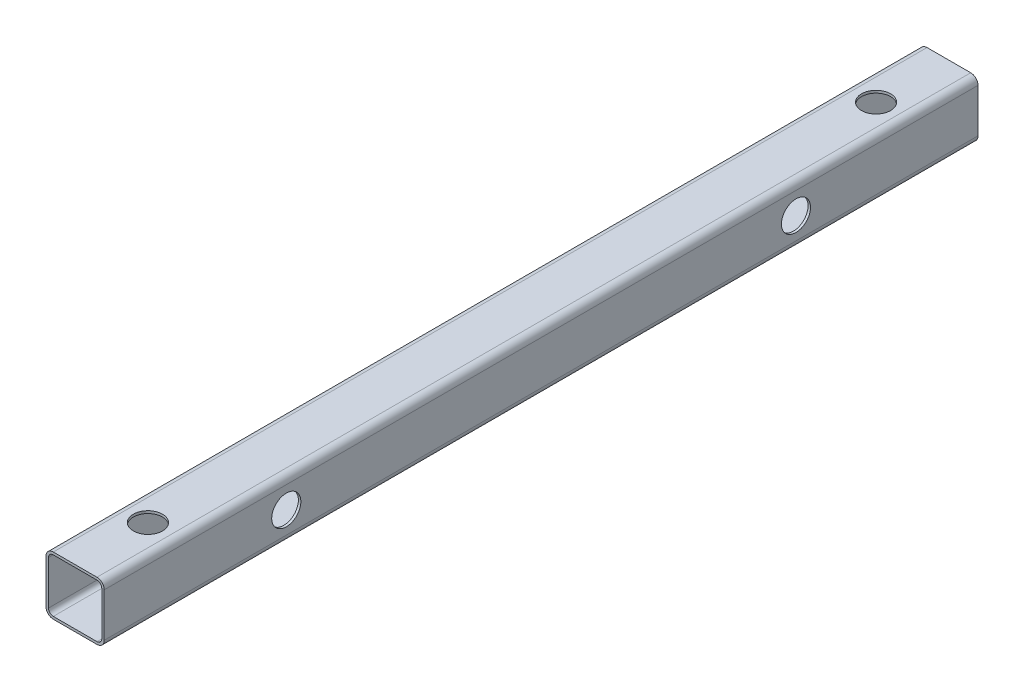
ISO-10303-21;
HEADER;
FILE_DESCRIPTION(('STEP AP214'),'2;1');
FILE_NAME('part.step','',(''),(''),'','','');
FILE_SCHEMA(('AUTOMOTIVE_DESIGN { 1 0 10303 214 1 1 1 1 }'));
ENDSEC;
DATA;
#1=APPLICATION_CONTEXT('core data for automotive mechanical design processes');
#2=APPLICATION_PROTOCOL_DEFINITION('international standard','automotive_design',2000,#1);
#3=PRODUCT_CONTEXT('',#1,'mechanical');
#4=PRODUCT('Part','Part','',(#3));
#5=PRODUCT_RELATED_PRODUCT_CATEGORY('part','',(#4));
#6=PRODUCT_DEFINITION_FORMATION('','',#4);
#7=PRODUCT_DEFINITION_CONTEXT('part definition',#1,'design');
#8=PRODUCT_DEFINITION('design','',#6,#7);
#9=PRODUCT_DEFINITION_SHAPE('','',#8);
#10=(LENGTH_UNIT() NAMED_UNIT(*) SI_UNIT(.MILLI.,.METRE.));
#11=(NAMED_UNIT(*) PLANE_ANGLE_UNIT() SI_UNIT($,.RADIAN.));
#12=(NAMED_UNIT(*) SI_UNIT($,.STERADIAN.) SOLID_ANGLE_UNIT());
#13=UNCERTAINTY_MEASURE_WITH_UNIT(LENGTH_MEASURE(1.E-05),#10,'distance_accuracy_value','');
#14=(GEOMETRIC_REPRESENTATION_CONTEXT(3) GLOBAL_UNCERTAINTY_ASSIGNED_CONTEXT((#13)) GLOBAL_UNIT_ASSIGNED_CONTEXT((#10,
#11,#12)) REPRESENTATION_CONTEXT('',''));
#15=CARTESIAN_POINT('',(0.,0.,0.));
#16=DIRECTION('',(0.,0.,1.));
#17=DIRECTION('',(1.,0.,0.));
#18=AXIS2_PLACEMENT_3D('',#15,#16,#17);
#19=CARTESIAN_POINT('',(-6.,-6.,-120.));
#20=DIRECTION('',(0.,0.,1.));
#21=DIRECTION('',(1.,0.,0.));
#22=AXIS2_PLACEMENT_3D('',#19,#20,#21);
#23=CYLINDRICAL_SURFACE('',#22,2.);
#24=DIRECTION('',(0.,0.,1.));
#25=VECTOR('',#24,1.);
#26=CARTESIAN_POINT('',(-5.99999999999999,-8.,-120.));
#27=LINE('',#26,#25);
#28=CARTESIAN_POINT('',(-5.99999999999999,-8.,-120.));
#29=VERTEX_POINT('',#28);
#30=CARTESIAN_POINT('',(-5.99999999999999,-8.,120.));
#31=VERTEX_POINT('',#30);
#32=EDGE_CURVE('E315',#29,#31,#27,.T.);
#33=ORIENTED_EDGE('',*,*,#32,.T.);
#34=CARTESIAN_POINT('',(-6.,-6.,120.));
#35=DIRECTION('',(0.,0.,1.));
#36=DIRECTION('',(-1.,0.,0.));
#37=AXIS2_PLACEMENT_3D('',#34,#35,#36);
#38=CIRCLE('',#37,2.);
#39=CARTESIAN_POINT('',(-8.,-5.99999999999999,120.));
#40=VERTEX_POINT('',#39);
#41=EDGE_CURVE('E208',#40,#31,#38,.T.);
#42=ORIENTED_EDGE('',*,*,#41,.F.);
#43=DIRECTION('',(0.,0.,1.));
#44=VECTOR('',#43,1.);
#45=CARTESIAN_POINT('',(-8.,-5.99999999999999,-120.));
#46=LINE('',#45,#44);
#47=CARTESIAN_POINT('',(-8.,-5.99999999999999,-120.));
#48=VERTEX_POINT('',#47);
#49=EDGE_CURVE('E11',#48,#40,#46,.T.);
#50=ORIENTED_EDGE('',*,*,#49,.F.);
#51=CARTESIAN_POINT('',(-6.,-6.,-120.));
#52=DIRECTION('',(0.,0.,1.));
#53=DIRECTION('',(-1.,0.,0.));
#54=AXIS2_PLACEMENT_3D('',#51,#52,#53);
#55=CIRCLE('',#54,2.);
#56=EDGE_CURVE('E268',#48,#29,#55,.T.);
#57=ORIENTED_EDGE('',*,*,#56,.T.);
#58=EDGE_LOOP('',(#33,#42,#50,#57));
#59=FACE_BOUND('',#58,.T.);
#60=ADVANCED_FACE('F40',(#59),#23,.T.);
#61=CARTESIAN_POINT('',(-8.,-5.99999999999999,-120.));
#62=DIRECTION('',(-1.,0.,0.));
#63=DIRECTION('',(0.,0.,1.));
#64=AXIS2_PLACEMENT_3D('',#61,#62,#63);
#65=PLANE('',#64);
#66=CARTESIAN_POINT('',(-8.,0.,70.));
#67=DIRECTION('',(1.,0.,0.));
#68=DIRECTION('',(0.,0.,-1.));
#69=AXIS2_PLACEMENT_3D('',#66,#67,#68);
#70=CIRCLE('',#69,3.99999999999999);
#71=CARTESIAN_POINT('',(-8.,0.,66.));
#72=VERTEX_POINT('',#71);
#73=EDGE_CURVE('E351',#72,#72,#70,.T.);
#74=ORIENTED_EDGE('',*,*,#73,.T.);
#75=EDGE_LOOP('',(#74));
#76=FACE_BOUND('',#75,.T.);
#77=CARTESIAN_POINT('',(-8.,0.,-70.));
#78=DIRECTION('',(1.,0.,0.));
#79=DIRECTION('',(0.,0.,1.));
#80=AXIS2_PLACEMENT_3D('',#77,#78,#79);
#81=CIRCLE('',#80,3.99999999999999);
#82=CARTESIAN_POINT('',(-8.,0.,-66.));
#83=VERTEX_POINT('',#82);
#84=EDGE_CURVE('E365',#83,#83,#81,.T.);
#85=ORIENTED_EDGE('',*,*,#84,.T.);
#86=EDGE_LOOP('',(#85));
#87=FACE_BOUND('',#86,.T.);
#88=ORIENTED_EDGE('',*,*,#49,.T.);
#89=DIRECTION('',(0.,-1.,0.));
#90=VECTOR('',#89,1.);
#91=CARTESIAN_POINT('',(-8.,-5.99999999999999,120.));
#92=LINE('',#91,#90);
#93=CARTESIAN_POINT('',(-8.,5.99999999999999,120.));
#94=VERTEX_POINT('',#93);
#95=EDGE_CURVE('E236',#94,#40,#92,.T.);
#96=ORIENTED_EDGE('',*,*,#95,.F.);
#97=DIRECTION('',(0.,0.,1.));
#98=VECTOR('',#97,1.);
#99=CARTESIAN_POINT('',(-8.,5.99999999999999,-120.));
#100=LINE('',#99,#98);
#101=CARTESIAN_POINT('',(-8.,5.99999999999999,-120.));
#102=VERTEX_POINT('',#101);
#103=EDGE_CURVE('E49',#102,#94,#100,.T.);
#104=ORIENTED_EDGE('',*,*,#103,.F.);
#105=DIRECTION('',(0.,-1.,0.));
#106=VECTOR('',#105,1.);
#107=CARTESIAN_POINT('',(-8.,-5.99999999999999,-120.));
#108=LINE('',#107,#106);
#109=EDGE_CURVE('E312',#102,#48,#108,.T.);
#110=ORIENTED_EDGE('',*,*,#109,.T.);
#111=EDGE_LOOP('',(#88,#96,#104,#110));
#112=FACE_BOUND('',#111,.T.);
#113=ADVANCED_FACE('F419',(#76,#87,#112),#65,.T.);
#114=CARTESIAN_POINT('',(-6.,6.,-120.));
#115=DIRECTION('',(0.,0.,1.));
#116=DIRECTION('',(1.,0.,0.));
#117=AXIS2_PLACEMENT_3D('',#114,#115,#116);
#118=CYLINDRICAL_SURFACE('',#117,2.);
#119=ORIENTED_EDGE('',*,*,#103,.T.);
#120=CARTESIAN_POINT('',(-6.,6.,120.));
#121=DIRECTION('',(0.,0.,1.));
#122=DIRECTION('',(-1.,0.,0.));
#123=AXIS2_PLACEMENT_3D('',#120,#121,#122);
#124=CIRCLE('',#123,2.);
#125=CARTESIAN_POINT('',(-5.99999999999999,8.,120.));
#126=VERTEX_POINT('',#125);
#127=EDGE_CURVE('E232',#126,#94,#124,.T.);
#128=ORIENTED_EDGE('',*,*,#127,.F.);
#129=DIRECTION('',(0.,0.,1.));
#130=VECTOR('',#129,1.);
#131=CARTESIAN_POINT('',(-5.99999999999999,8.,-120.));
#132=LINE('',#131,#130);
#133=CARTESIAN_POINT('',(-5.99999999999999,8.,-120.));
#134=VERTEX_POINT('',#133);
#135=EDGE_CURVE('E319',#134,#126,#132,.T.);
#136=ORIENTED_EDGE('',*,*,#135,.F.);
#137=CARTESIAN_POINT('',(-6.,6.,-120.));
#138=DIRECTION('',(0.,0.,1.));
#139=DIRECTION('',(-1.,0.,0.));
#140=AXIS2_PLACEMENT_3D('',#137,#138,#139);
#141=CIRCLE('',#140,2.);
#142=EDGE_CURVE('E308',#134,#102,#141,.T.);
#143=ORIENTED_EDGE('',*,*,#142,.T.);
#144=EDGE_LOOP('',(#119,#128,#136,#143));
#145=FACE_BOUND('',#144,.T.);
#146=ADVANCED_FACE('F405',(#145),#118,.T.);
#147=CARTESIAN_POINT('',(-5.99999999999999,8.,-120.));
#148=DIRECTION('',(0.,1.,0.));
#149=DIRECTION('',(0.,0.,1.));
#150=AXIS2_PLACEMENT_3D('',#147,#148,#149);
#151=PLANE('',#150);
#152=CARTESIAN_POINT('',(0.,8.,100.));
#153=DIRECTION('',(0.,1.,0.));
#154=DIRECTION('',(0.,0.,1.));
#155=AXIS2_PLACEMENT_3D('',#152,#153,#154);
#156=CIRCLE('',#155,4.);
#157=CARTESIAN_POINT('',(0.,8.,104.));
#158=VERTEX_POINT('',#157);
#159=EDGE_CURVE('E177',#158,#158,#156,.T.);
#160=ORIENTED_EDGE('',*,*,#159,.F.);
#161=EDGE_LOOP('',(#160));
#162=FACE_BOUND('',#161,.T.);
#163=CARTESIAN_POINT('',(0.,8.,-100.));
#164=DIRECTION('',(0.,1.,0.));
#165=DIRECTION('',(0.,0.,1.));
#166=AXIS2_PLACEMENT_3D('',#163,#164,#165);
#167=CIRCLE('',#166,4.);
#168=CARTESIAN_POINT('',(0.,8.,-96.));
#169=VERTEX_POINT('',#168);
#170=EDGE_CURVE('E346',#169,#169,#167,.T.);
#171=ORIENTED_EDGE('',*,*,#170,.F.);
#172=EDGE_LOOP('',(#171));
#173=FACE_BOUND('',#172,.T.);
#174=ORIENTED_EDGE('',*,*,#135,.T.);
#175=DIRECTION('',(-1.,0.,0.));
#176=VECTOR('',#175,1.);
#177=CARTESIAN_POINT('',(-5.99999999999999,8.,120.));
#178=LINE('',#177,#176);
#179=CARTESIAN_POINT('',(5.99999999999999,8.,120.));
#180=VERTEX_POINT('',#179);
#181=EDGE_CURVE('E228',#180,#126,#178,.T.);
#182=ORIENTED_EDGE('',*,*,#181,.F.);
#183=DIRECTION('',(0.,0.,1.));
#184=VECTOR('',#183,1.);
#185=CARTESIAN_POINT('',(5.99999999999999,8.,-120.));
#186=LINE('',#185,#184);
#187=CARTESIAN_POINT('',(5.99999999999999,8.,-120.));
#188=VERTEX_POINT('',#187);
#189=EDGE_CURVE('E322',#188,#180,#186,.T.);
#190=ORIENTED_EDGE('',*,*,#189,.F.);
#191=DIRECTION('',(-1.,0.,0.));
#192=VECTOR('',#191,1.);
#193=CARTESIAN_POINT('',(-5.99999999999999,8.,-120.));
#194=LINE('',#193,#192);
#195=EDGE_CURVE('E304',#188,#134,#194,.T.);
#196=ORIENTED_EDGE('',*,*,#195,.T.);
#197=EDGE_LOOP('',(#174,#182,#190,#196));
#198=FACE_BOUND('',#197,.T.);
#199=ADVANCED_FACE('F401',(#162,#173,#198),#151,.T.);
#200=CARTESIAN_POINT('',(6.,6.,-120.));
#201=DIRECTION('',(0.,0.,1.));
#202=DIRECTION('',(1.,0.,0.));
#203=AXIS2_PLACEMENT_3D('',#200,#201,#202);
#204=CYLINDRICAL_SURFACE('',#203,2.);
#205=ORIENTED_EDGE('',*,*,#189,.T.);
#206=CARTESIAN_POINT('',(6.,6.,120.));
#207=DIRECTION('',(0.,0.,1.));
#208=DIRECTION('',(-1.,0.,0.));
#209=AXIS2_PLACEMENT_3D('',#206,#207,#208);
#210=CIRCLE('',#209,2.);
#211=CARTESIAN_POINT('',(8.,5.99999999999999,120.));
#212=VERTEX_POINT('',#211);
#213=EDGE_CURVE('E224',#212,#180,#210,.T.);
#214=ORIENTED_EDGE('',*,*,#213,.F.);
#215=DIRECTION('',(0.,0.,1.));
#216=VECTOR('',#215,1.);
#217=CARTESIAN_POINT('',(8.,5.99999999999999,-120.));
#218=LINE('',#217,#216);
#219=CARTESIAN_POINT('',(8.,5.99999999999999,-120.));
#220=VERTEX_POINT('',#219);
#221=EDGE_CURVE('E325',#220,#212,#218,.T.);
#222=ORIENTED_EDGE('',*,*,#221,.F.);
#223=CARTESIAN_POINT('',(6.,6.,-120.));
#224=DIRECTION('',(0.,0.,1.));
#225=DIRECTION('',(-1.,0.,0.));
#226=AXIS2_PLACEMENT_3D('',#223,#224,#225);
#227=CIRCLE('',#226,2.);
#228=EDGE_CURVE('E300',#220,#188,#227,.T.);
#229=ORIENTED_EDGE('',*,*,#228,.T.);
#230=EDGE_LOOP('',(#205,#214,#222,#229));
#231=FACE_BOUND('',#230,.T.);
#232=ADVANCED_FACE('F404',(#231),#204,.T.);
#233=CARTESIAN_POINT('',(8.,-5.99999999999999,-120.));
#234=DIRECTION('',(1.,0.,0.));
#235=DIRECTION('',(0.,0.,-1.));
#236=AXIS2_PLACEMENT_3D('',#233,#234,#235);
#237=PLANE('',#236);
#238=CARTESIAN_POINT('',(8.,0.,70.));
#239=DIRECTION('',(1.,0.,0.));
#240=DIRECTION('',(0.,0.,-1.));
#241=AXIS2_PLACEMENT_3D('',#238,#239,#240);
#242=CIRCLE('',#241,3.99999999999999);
#243=CARTESIAN_POINT('',(8.,0.,66.));
#244=VERTEX_POINT('',#243);
#245=EDGE_CURVE('E359',#244,#244,#242,.T.);
#246=ORIENTED_EDGE('',*,*,#245,.F.);
#247=EDGE_LOOP('',(#246));
#248=FACE_BOUND('',#247,.T.);
#249=CARTESIAN_POINT('',(8.,0.,-70.));
#250=DIRECTION('',(1.,0.,0.));
#251=DIRECTION('',(0.,0.,1.));
#252=AXIS2_PLACEMENT_3D('',#249,#250,#251);
#253=CIRCLE('',#252,3.99999999999999);
#254=CARTESIAN_POINT('',(8.,0.,-66.));
#255=VERTEX_POINT('',#254);
#256=EDGE_CURVE('E371',#255,#255,#253,.T.);
#257=ORIENTED_EDGE('',*,*,#256,.F.);
#258=EDGE_LOOP('',(#257));
#259=FACE_BOUND('',#258,.T.);
#260=ORIENTED_EDGE('',*,*,#221,.T.);
#261=DIRECTION('',(0.,1.,0.));
#262=VECTOR('',#261,1.);
#263=CARTESIAN_POINT('',(8.,-5.99999999999999,120.));
#264=LINE('',#263,#262);
#265=CARTESIAN_POINT('',(8.,-6.,120.));
#266=VERTEX_POINT('',#265);
#267=EDGE_CURVE('E220',#266,#212,#264,.T.);
#268=ORIENTED_EDGE('',*,*,#267,.F.);
#269=DIRECTION('',(0.,0.,1.));
#270=VECTOR('',#269,1.);
#271=CARTESIAN_POINT('',(8.,-6.,-120.));
#272=LINE('',#271,#270);
#273=CARTESIAN_POINT('',(8.,-6.,-120.));
#274=VERTEX_POINT('',#273);
#275=EDGE_CURVE('E328',#274,#266,#272,.T.);
#276=ORIENTED_EDGE('',*,*,#275,.F.);
#277=DIRECTION('',(0.,1.,0.));
#278=VECTOR('',#277,1.);
#279=CARTESIAN_POINT('',(8.,-5.99999999999999,-120.));
#280=LINE('',#279,#278);
#281=EDGE_CURVE('E296',#274,#220,#280,.T.);
#282=ORIENTED_EDGE('',*,*,#281,.T.);
#283=EDGE_LOOP('',(#260,#268,#276,#282));
#284=FACE_BOUND('',#283,.T.);
#285=ADVANCED_FACE('F431',(#248,#259,#284),#237,.T.);
#286=CARTESIAN_POINT('',(6.,-6.,-120.));
#287=DIRECTION('',(0.,0.,1.));
#288=DIRECTION('',(1.,0.,0.));
#289=AXIS2_PLACEMENT_3D('',#286,#287,#288);
#290=CYLINDRICAL_SURFACE('',#289,2.);
#291=ORIENTED_EDGE('',*,*,#275,.T.);
#292=CARTESIAN_POINT('',(6.,-6.,120.));
#293=DIRECTION('',(0.,0.,1.));
#294=DIRECTION('',(1.,0.,0.));
#295=AXIS2_PLACEMENT_3D('',#292,#293,#294);
#296=CIRCLE('',#295,2.);
#297=CARTESIAN_POINT('',(5.99999999999999,-8.,120.));
#298=VERTEX_POINT('',#297);
#299=EDGE_CURVE('E216',#298,#266,#296,.T.);
#300=ORIENTED_EDGE('',*,*,#299,.F.);
#301=DIRECTION('',(0.,0.,1.));
#302=VECTOR('',#301,1.);
#303=CARTESIAN_POINT('',(5.99999999999999,-8.,-120.));
#304=LINE('',#303,#302);
#305=CARTESIAN_POINT('',(5.99999999999999,-8.,-120.));
#306=VERTEX_POINT('',#305);
#307=EDGE_CURVE('E331',#306,#298,#304,.T.);
#308=ORIENTED_EDGE('',*,*,#307,.F.);
#309=CARTESIAN_POINT('',(6.,-6.,-120.));
#310=DIRECTION('',(0.,0.,1.));
#311=DIRECTION('',(1.,0.,0.));
#312=AXIS2_PLACEMENT_3D('',#309,#310,#311);
#313=CIRCLE('',#312,2.);
#314=EDGE_CURVE('E292',#306,#274,#313,.T.);
#315=ORIENTED_EDGE('',*,*,#314,.T.);
#316=EDGE_LOOP('',(#291,#300,#308,#315));
#317=FACE_BOUND('',#316,.T.);
#318=ADVANCED_FACE('F427',(#317),#290,.T.);
#319=CARTESIAN_POINT('',(-5.99999999999999,-8.,-120.));
#320=DIRECTION('',(0.,-1.,0.));
#321=DIRECTION('',(0.,0.,-1.));
#322=AXIS2_PLACEMENT_3D('',#319,#320,#321);
#323=PLANE('',#322);
#324=CARTESIAN_POINT('',(0.,-8.,100.));
#325=DIRECTION('',(0.,1.,0.));
#326=DIRECTION('',(0.,0.,1.));
#327=AXIS2_PLACEMENT_3D('',#324,#325,#326);
#328=CIRCLE('',#327,4.);
#329=CARTESIAN_POINT('',(0.,-8.,104.));
#330=VERTEX_POINT('',#329);
#331=EDGE_CURVE('E341',#330,#330,#328,.T.);
#332=ORIENTED_EDGE('',*,*,#331,.T.);
#333=EDGE_LOOP('',(#332));
#334=FACE_BOUND('',#333,.T.);
#335=CARTESIAN_POINT('',(0.,-8.,-100.));
#336=DIRECTION('',(0.,1.,0.));
#337=DIRECTION('',(0.,0.,-1.));
#338=AXIS2_PLACEMENT_3D('',#335,#336,#337);
#339=CIRCLE('',#338,4.);
#340=CARTESIAN_POINT('',(0.,-8.,-104.));
#341=VERTEX_POINT('',#340);
#342=EDGE_CURVE('E379',#341,#341,#339,.T.);
#343=ORIENTED_EDGE('',*,*,#342,.T.);
#344=EDGE_LOOP('',(#343));
#345=FACE_BOUND('',#344,.T.);
#346=ORIENTED_EDGE('',*,*,#307,.T.);
#347=DIRECTION('',(1.,0.,0.));
#348=VECTOR('',#347,1.);
#349=CARTESIAN_POINT('',(-5.99999999999999,-8.,120.));
#350=LINE('',#349,#348);
#351=EDGE_CURVE('E212',#31,#298,#350,.T.);
#352=ORIENTED_EDGE('',*,*,#351,.F.);
#353=ORIENTED_EDGE('',*,*,#32,.F.);
#354=DIRECTION('',(1.,0.,0.));
#355=VECTOR('',#354,1.);
#356=CARTESIAN_POINT('',(-5.99999999999999,-8.,-120.));
#357=LINE('',#356,#355);
#358=EDGE_CURVE('E288',#29,#306,#357,.T.);
#359=ORIENTED_EDGE('',*,*,#358,.T.);
#360=EDGE_LOOP('',(#346,#352,#353,#359));
#361=FACE_BOUND('',#360,.T.);
#362=ADVANCED_FACE('F423',(#334,#345,#361),#323,.T.);
#363=CARTESIAN_POINT('',(-6.,-6.,-120.));
#364=DIRECTION('',(0.,0.,-1.));
#365=DIRECTION('',(-1.,0.,0.));
#366=AXIS2_PLACEMENT_3D('',#363,#364,#365);
#367=PLANE('',#366);
#368=CARTESIAN_POINT('',(-6.,6.,-120.));
#369=DIRECTION('',(0.,0.,1.));
#370=DIRECTION('',(-1.,0.,0.));
#371=AXIS2_PLACEMENT_3D('',#368,#369,#370);
#372=CIRCLE('',#371,1.32);
#373=CARTESIAN_POINT('',(-5.99999999999999,7.32,-120.));
#374=VERTEX_POINT('',#373);
#375=CARTESIAN_POINT('',(-7.32,5.99999999999999,-120.));
#376=VERTEX_POINT('',#375);
#377=EDGE_CURVE('E240',#374,#376,#372,.T.);
#378=ORIENTED_EDGE('',*,*,#377,.T.);
#379=DIRECTION('',(0.,-1.,0.));
#380=VECTOR('',#379,1.);
#381=CARTESIAN_POINT('',(-7.32,-5.99999999999999,-120.));
#382=LINE('',#381,#380);
#383=CARTESIAN_POINT('',(-7.32,-6.,-120.));
#384=VERTEX_POINT('',#383);
#385=EDGE_CURVE('E161',#376,#384,#382,.T.);
#386=ORIENTED_EDGE('',*,*,#385,.T.);
#387=CARTESIAN_POINT('',(-6.,-6.,-120.));
#388=DIRECTION('',(0.,0.,1.));
#389=DIRECTION('',(-1.,0.,0.));
#390=AXIS2_PLACEMENT_3D('',#387,#388,#389);
#391=CIRCLE('',#390,1.32);
#392=CARTESIAN_POINT('',(-5.99999999999999,-7.32,-120.));
#393=VERTEX_POINT('',#392);
#394=EDGE_CURVE('E57',#384,#393,#391,.T.);
#395=ORIENTED_EDGE('',*,*,#394,.T.);
#396=DIRECTION('',(1.,0.,0.));
#397=VECTOR('',#396,1.);
#398=CARTESIAN_POINT('',(-5.99999999999999,-7.32,-120.));
#399=LINE('',#398,#397);
#400=CARTESIAN_POINT('',(5.99999999999999,-7.32,-120.));
#401=VERTEX_POINT('',#400);
#402=EDGE_CURVE('E247',#393,#401,#399,.T.);
#403=ORIENTED_EDGE('',*,*,#402,.T.);
#404=CARTESIAN_POINT('',(6.,-6.,-120.));
#405=DIRECTION('',(0.,0.,1.));
#406=DIRECTION('',(1.,0.,0.));
#407=AXIS2_PLACEMENT_3D('',#404,#405,#406);
#408=CIRCLE('',#407,1.32);
#409=CARTESIAN_POINT('',(7.32,-5.99999999999999,-120.));
#410=VERTEX_POINT('',#409);
#411=EDGE_CURVE('E251',#401,#410,#408,.T.);
#412=ORIENTED_EDGE('',*,*,#411,.T.);
#413=DIRECTION('',(0.,1.,0.));
#414=VECTOR('',#413,1.);
#415=CARTESIAN_POINT('',(7.32,-5.99999999999999,-120.));
#416=LINE('',#415,#414);
#417=CARTESIAN_POINT('',(7.32,5.99999999999999,-120.));
#418=VERTEX_POINT('',#417);
#419=EDGE_CURVE('E255',#410,#418,#416,.T.);
#420=ORIENTED_EDGE('',*,*,#419,.T.);
#421=CARTESIAN_POINT('',(6.,6.,-120.));
#422=DIRECTION('',(0.,0.,1.));
#423=DIRECTION('',(-1.,0.,0.));
#424=AXIS2_PLACEMENT_3D('',#421,#422,#423);
#425=CIRCLE('',#424,1.32);
#426=CARTESIAN_POINT('',(5.99999999999999,7.32,-120.));
#427=VERTEX_POINT('',#426);
#428=EDGE_CURVE('E259',#418,#427,#425,.T.);
#429=ORIENTED_EDGE('',*,*,#428,.T.);
#430=DIRECTION('',(-1.,0.,0.));
#431=VECTOR('',#430,1.);
#432=CARTESIAN_POINT('',(-5.99999999999999,7.32,-120.));
#433=LINE('',#432,#431);
#434=EDGE_CURVE('E167',#427,#374,#433,.T.);
#435=ORIENTED_EDGE('',*,*,#434,.T.);
#436=EDGE_LOOP('',(#378,#386,#395,#403,#412,#420,#429,#435));
#437=FACE_BOUND('',#436,.T.);
#438=ORIENTED_EDGE('',*,*,#56,.F.);
#439=ORIENTED_EDGE('',*,*,#109,.F.);
#440=ORIENTED_EDGE('',*,*,#142,.F.);
#441=ORIENTED_EDGE('',*,*,#195,.F.);
#442=ORIENTED_EDGE('',*,*,#228,.F.);
#443=ORIENTED_EDGE('',*,*,#281,.F.);
#444=ORIENTED_EDGE('',*,*,#314,.F.);
#445=ORIENTED_EDGE('',*,*,#358,.F.);
#446=EDGE_LOOP('',(#438,#439,#440,#441,#442,#443,#444,#445));
#447=FACE_BOUND('',#446,.T.);
#448=ADVANCED_FACE('F434',(#437,#447),#367,.T.);
#449=CARTESIAN_POINT('',(-6.,6.,-120.));
#450=DIRECTION('',(0.,0.,1.));
#451=DIRECTION('',(1.,0.,0.));
#452=AXIS2_PLACEMENT_3D('',#449,#450,#451);
#453=CYLINDRICAL_SURFACE('',#452,1.32);
#454=DIRECTION('',(0.,0.,1.));
#455=VECTOR('',#454,1.);
#456=CARTESIAN_POINT('',(-5.99999999999999,7.32,-120.));
#457=LINE('',#456,#455);
#458=CARTESIAN_POINT('',(-5.99999999999999,7.32,120.));
#459=VERTEX_POINT('',#458);
#460=EDGE_CURVE('E172',#374,#459,#457,.T.);
#461=ORIENTED_EDGE('',*,*,#460,.T.);
#462=CARTESIAN_POINT('',(-6.,6.,120.));
#463=DIRECTION('',(0.,0.,1.));
#464=DIRECTION('',(-1.,0.,0.));
#465=AXIS2_PLACEMENT_3D('',#462,#463,#464);
#466=CIRCLE('',#465,1.32);
#467=CARTESIAN_POINT('',(-7.32,5.99999999999999,120.));
#468=VERTEX_POINT('',#467);
#469=EDGE_CURVE('E170',#459,#468,#466,.T.);
#470=ORIENTED_EDGE('',*,*,#469,.T.);
#471=DIRECTION('',(0.,0.,1.));
#472=VECTOR('',#471,1.);
#473=CARTESIAN_POINT('',(-7.32,5.99999999999999,-120.));
#474=LINE('',#473,#472);
#475=EDGE_CURVE('E154',#376,#468,#474,.T.);
#476=ORIENTED_EDGE('',*,*,#475,.F.);
#477=ORIENTED_EDGE('',*,*,#377,.F.);
#478=EDGE_LOOP('',(#461,#470,#476,#477));
#479=FACE_BOUND('',#478,.T.);
#480=ADVANCED_FACE('F171',(#479),#453,.F.);
#481=CARTESIAN_POINT('',(-5.99999999999999,7.32,-120.));
#482=DIRECTION('',(0.,1.,0.));
#483=DIRECTION('',(0.,0.,1.));
#484=AXIS2_PLACEMENT_3D('',#481,#482,#483);
#485=PLANE('',#484);
#486=CARTESIAN_POINT('',(0.,7.32,100.));
#487=DIRECTION('',(0.,1.,0.));
#488=DIRECTION('',(0.,0.,1.));
#489=AXIS2_PLACEMENT_3D('',#486,#487,#488);
#490=CIRCLE('',#489,4.);
#491=CARTESIAN_POINT('',(0.,7.32,104.));
#492=VERTEX_POINT('',#491);
#493=EDGE_CURVE('E345',#492,#492,#490,.T.);
#494=ORIENTED_EDGE('',*,*,#493,.T.);
#495=EDGE_LOOP('',(#494));
#496=FACE_BOUND('',#495,.T.);
#497=CARTESIAN_POINT('',(0.,7.32,-100.));
#498=DIRECTION('',(0.,1.,0.));
#499=DIRECTION('',(0.,0.,1.));
#500=AXIS2_PLACEMENT_3D('',#497,#498,#499);
#501=CIRCLE('',#500,4.);
#502=CARTESIAN_POINT('',(0.,7.32,-96.));
#503=VERTEX_POINT('',#502);
#504=EDGE_CURVE('E340',#503,#503,#501,.T.);
#505=ORIENTED_EDGE('',*,*,#504,.T.);
#506=EDGE_LOOP('',(#505));
#507=FACE_BOUND('',#506,.T.);
#508=DIRECTION('',(0.,0.,1.));
#509=VECTOR('',#508,1.);
#510=CARTESIAN_POINT('',(5.99999999999999,7.32,-120.));
#511=LINE('',#510,#509);
#512=CARTESIAN_POINT('',(5.99999999999999,7.32,120.));
#513=VERTEX_POINT('',#512);
#514=EDGE_CURVE('E269',#427,#513,#511,.T.);
#515=ORIENTED_EDGE('',*,*,#514,.T.);
#516=DIRECTION('',(-1.,0.,0.));
#517=VECTOR('',#516,1.);
#518=CARTESIAN_POINT('',(-5.99999999999999,7.32,120.));
#519=LINE('',#518,#517);
#520=EDGE_CURVE('E205',#513,#459,#519,.T.);
#521=ORIENTED_EDGE('',*,*,#520,.T.);
#522=ORIENTED_EDGE('',*,*,#460,.F.);
#523=ORIENTED_EDGE('',*,*,#434,.F.);
#524=EDGE_LOOP('',(#515,#521,#522,#523));
#525=FACE_BOUND('',#524,.T.);
#526=ADVANCED_FACE('F462',(#496,#507,#525),#485,.F.);
#527=CARTESIAN_POINT('',(6.,6.,-120.));
#528=DIRECTION('',(0.,0.,1.));
#529=DIRECTION('',(1.,0.,0.));
#530=AXIS2_PLACEMENT_3D('',#527,#528,#529);
#531=CYLINDRICAL_SURFACE('',#530,1.32);
#532=DIRECTION('',(0.,0.,1.));
#533=VECTOR('',#532,1.);
#534=CARTESIAN_POINT('',(7.32,5.99999999999999,-120.));
#535=LINE('',#534,#533);
#536=CARTESIAN_POINT('',(7.32,5.99999999999999,120.));
#537=VERTEX_POINT('',#536);
#538=EDGE_CURVE('E272',#418,#537,#535,.T.);
#539=ORIENTED_EDGE('',*,*,#538,.T.);
#540=CARTESIAN_POINT('',(6.,6.,120.));
#541=DIRECTION('',(0.,0.,1.));
#542=DIRECTION('',(-1.,0.,0.));
#543=AXIS2_PLACEMENT_3D('',#540,#541,#542);
#544=CIRCLE('',#543,1.32);
#545=EDGE_CURVE('E201',#537,#513,#544,.T.);
#546=ORIENTED_EDGE('',*,*,#545,.T.);
#547=ORIENTED_EDGE('',*,*,#514,.F.);
#548=ORIENTED_EDGE('',*,*,#428,.F.);
#549=EDGE_LOOP('',(#539,#546,#547,#548));
#550=FACE_BOUND('',#549,.T.);
#551=ADVANCED_FACE('F480',(#550),#531,.F.);
#552=CARTESIAN_POINT('',(7.32,-5.99999999999999,-120.));
#553=DIRECTION('',(1.,0.,0.));
#554=DIRECTION('',(0.,0.,-1.));
#555=AXIS2_PLACEMENT_3D('',#552,#553,#554);
#556=PLANE('',#555);
#557=CARTESIAN_POINT('',(7.32,0.,70.));
#558=DIRECTION('',(1.,0.,0.));
#559=DIRECTION('',(0.,0.,-1.));
#560=AXIS2_PLACEMENT_3D('',#557,#558,#559);
#561=CIRCLE('',#560,3.99999999999999);
#562=CARTESIAN_POINT('',(7.32,0.,66.));
#563=VERTEX_POINT('',#562);
#564=EDGE_CURVE('E375',#563,#563,#561,.T.);
#565=ORIENTED_EDGE('',*,*,#564,.T.);
#566=EDGE_LOOP('',(#565));
#567=FACE_BOUND('',#566,.T.);
#568=CARTESIAN_POINT('',(7.32,0.,-70.));
#569=DIRECTION('',(1.,0.,0.));
#570=DIRECTION('',(0.,0.,-1.));
#571=AXIS2_PLACEMENT_3D('',#568,#569,#570);
#572=CIRCLE('',#571,3.99999999999999);
#573=CARTESIAN_POINT('',(7.32,0.,-74.));
#574=VERTEX_POINT('',#573);
#575=EDGE_CURVE('E350',#574,#574,#572,.T.);
#576=ORIENTED_EDGE('',*,*,#575,.T.);
#577=EDGE_LOOP('',(#576));
#578=FACE_BOUND('',#577,.T.);
#579=DIRECTION('',(0.,0.,1.));
#580=VECTOR('',#579,1.);
#581=CARTESIAN_POINT('',(7.32,-5.99999999999999,-120.));
#582=LINE('',#581,#580);
#583=CARTESIAN_POINT('',(7.32,-5.99999999999999,120.));
#584=VERTEX_POINT('',#583);
#585=EDGE_CURVE('E275',#410,#584,#582,.T.);
#586=ORIENTED_EDGE('',*,*,#585,.T.);
#587=DIRECTION('',(0.,1.,0.));
#588=VECTOR('',#587,1.);
#589=CARTESIAN_POINT('',(7.32,-5.99999999999999,120.));
#590=LINE('',#589,#588);
#591=EDGE_CURVE('E197',#584,#537,#590,.T.);
#592=ORIENTED_EDGE('',*,*,#591,.T.);
#593=ORIENTED_EDGE('',*,*,#538,.F.);
#594=ORIENTED_EDGE('',*,*,#419,.F.);
#595=EDGE_LOOP('',(#586,#592,#593,#594));
#596=FACE_BOUND('',#595,.T.);
#597=ADVANCED_FACE('F476',(#567,#578,#596),#556,.F.);
#598=CARTESIAN_POINT('',(6.,-6.,-120.));
#599=DIRECTION('',(0.,0.,1.));
#600=DIRECTION('',(1.,0.,0.));
#601=AXIS2_PLACEMENT_3D('',#598,#599,#600);
#602=CYLINDRICAL_SURFACE('',#601,1.32);
#603=DIRECTION('',(0.,0.,1.));
#604=VECTOR('',#603,1.);
#605=CARTESIAN_POINT('',(5.99999999999999,-7.32,-120.));
#606=LINE('',#605,#604);
#607=CARTESIAN_POINT('',(5.99999999999999,-7.32,120.));
#608=VERTEX_POINT('',#607);
#609=EDGE_CURVE('E278',#401,#608,#606,.T.);
#610=ORIENTED_EDGE('',*,*,#609,.T.);
#611=CARTESIAN_POINT('',(6.,-6.,120.));
#612=DIRECTION('',(0.,0.,1.));
#613=DIRECTION('',(1.,0.,0.));
#614=AXIS2_PLACEMENT_3D('',#611,#612,#613);
#615=CIRCLE('',#614,1.32);
#616=EDGE_CURVE('E193',#608,#584,#615,.T.);
#617=ORIENTED_EDGE('',*,*,#616,.T.);
#618=ORIENTED_EDGE('',*,*,#585,.F.);
#619=ORIENTED_EDGE('',*,*,#411,.F.);
#620=EDGE_LOOP('',(#610,#617,#618,#619));
#621=FACE_BOUND('',#620,.T.);
#622=ADVANCED_FACE('F472',(#621),#602,.F.);
#623=CARTESIAN_POINT('',(-5.99999999999999,-7.32,-120.));
#624=DIRECTION('',(0.,-1.,0.));
#625=DIRECTION('',(0.,0.,-1.));
#626=AXIS2_PLACEMENT_3D('',#623,#624,#625);
#627=PLANE('',#626);
#628=CARTESIAN_POINT('',(0.,-7.32,100.));
#629=DIRECTION('',(0.,-1.,0.));
#630=DIRECTION('',(0.,0.,-1.));
#631=AXIS2_PLACEMENT_3D('',#628,#629,#630);
#632=CIRCLE('',#631,4.);
#633=CARTESIAN_POINT('',(0.,-7.32,96.));
#634=VERTEX_POINT('',#633);
#635=EDGE_CURVE('E342',#634,#634,#632,.T.);
#636=ORIENTED_EDGE('',*,*,#635,.T.);
#637=EDGE_LOOP('',(#636));
#638=FACE_BOUND('',#637,.T.);
#639=CARTESIAN_POINT('',(0.,-7.32,-100.));
#640=DIRECTION('',(0.,-1.,0.));
#641=DIRECTION('',(0.,0.,-1.));
#642=AXIS2_PLACEMENT_3D('',#639,#640,#641);
#643=CIRCLE('',#642,4.);
#644=CARTESIAN_POINT('',(0.,-7.32,-104.));
#645=VERTEX_POINT('',#644);
#646=EDGE_CURVE('E336',#645,#645,#643,.T.);
#647=ORIENTED_EDGE('',*,*,#646,.T.);
#648=EDGE_LOOP('',(#647));
#649=FACE_BOUND('',#648,.T.);
#650=DIRECTION('',(0.,0.,1.));
#651=VECTOR('',#650,1.);
#652=CARTESIAN_POINT('',(-5.99999999999999,-7.32,-120.));
#653=LINE('',#652,#651);
#654=CARTESIAN_POINT('',(-5.99999999999999,-7.32,120.));
#655=VERTEX_POINT('',#654);
#656=EDGE_CURVE('E281',#393,#655,#653,.T.);
#657=ORIENTED_EDGE('',*,*,#656,.T.);
#658=DIRECTION('',(1.,0.,0.));
#659=VECTOR('',#658,1.);
#660=CARTESIAN_POINT('',(-5.99999999999999,-7.32,120.));
#661=LINE('',#660,#659);
#662=EDGE_CURVE('E186',#655,#608,#661,.T.);
#663=ORIENTED_EDGE('',*,*,#662,.T.);
#664=ORIENTED_EDGE('',*,*,#609,.F.);
#665=ORIENTED_EDGE('',*,*,#402,.F.);
#666=EDGE_LOOP('',(#657,#663,#664,#665));
#667=FACE_BOUND('',#666,.T.);
#668=ADVANCED_FACE('F469',(#638,#649,#667),#627,.F.);
#669=CARTESIAN_POINT('',(-6.,-6.,-120.));
#670=DIRECTION('',(0.,0.,1.));
#671=DIRECTION('',(1.,0.,0.));
#672=AXIS2_PLACEMENT_3D('',#669,#670,#671);
#673=CYLINDRICAL_SURFACE('',#672,1.32);
#674=DIRECTION('',(0.,0.,1.));
#675=VECTOR('',#674,1.);
#676=CARTESIAN_POINT('',(-7.32,-6.,-120.));
#677=LINE('',#676,#675);
#678=CARTESIAN_POINT('',(-7.32,-6.,120.));
#679=VERTEX_POINT('',#678);
#680=EDGE_CURVE('E166',#384,#679,#677,.T.);
#681=ORIENTED_EDGE('',*,*,#680,.T.);
#682=CARTESIAN_POINT('',(-6.,-6.,120.));
#683=DIRECTION('',(0.,0.,1.));
#684=DIRECTION('',(-1.,0.,0.));
#685=AXIS2_PLACEMENT_3D('',#682,#683,#684);
#686=CIRCLE('',#685,1.32);
#687=EDGE_CURVE('E182',#679,#655,#686,.T.);
#688=ORIENTED_EDGE('',*,*,#687,.T.);
#689=ORIENTED_EDGE('',*,*,#656,.F.);
#690=ORIENTED_EDGE('',*,*,#394,.F.);
#691=EDGE_LOOP('',(#681,#688,#689,#690));
#692=FACE_BOUND('',#691,.T.);
#693=ADVANCED_FACE('F465',(#692),#673,.F.);
#694=CARTESIAN_POINT('',(-7.32,-5.99999999999999,-120.));
#695=DIRECTION('',(-1.,0.,0.));
#696=DIRECTION('',(0.,0.,1.));
#697=AXIS2_PLACEMENT_3D('',#694,#695,#696);
#698=PLANE('',#697);
#699=CARTESIAN_POINT('',(-7.32,0.,70.));
#700=DIRECTION('',(-1.,0.,0.));
#701=DIRECTION('',(0.,0.,1.));
#702=AXIS2_PLACEMENT_3D('',#699,#700,#701);
#703=CIRCLE('',#702,3.99999999999999);
#704=CARTESIAN_POINT('',(-7.32,0.,74.));
#705=VERTEX_POINT('',#704);
#706=EDGE_CURVE('E43',#705,#705,#703,.T.);
#707=ORIENTED_EDGE('',*,*,#706,.T.);
#708=EDGE_LOOP('',(#707));
#709=FACE_BOUND('',#708,.T.);
#710=CARTESIAN_POINT('',(-7.32,0.,-70.));
#711=DIRECTION('',(-1.,0.,0.));
#712=DIRECTION('',(0.,0.,1.));
#713=AXIS2_PLACEMENT_3D('',#710,#711,#712);
#714=CIRCLE('',#713,3.99999999999999);
#715=CARTESIAN_POINT('',(-7.32,0.,-66.));
#716=VERTEX_POINT('',#715);
#717=EDGE_CURVE('E347',#716,#716,#714,.T.);
#718=ORIENTED_EDGE('',*,*,#717,.T.);
#719=EDGE_LOOP('',(#718));
#720=FACE_BOUND('',#719,.T.);
#721=ORIENTED_EDGE('',*,*,#475,.T.);
#722=DIRECTION('',(0.,-1.,0.));
#723=VECTOR('',#722,1.);
#724=CARTESIAN_POINT('',(-7.32,-5.99999999999999,120.));
#725=LINE('',#724,#723);
#726=EDGE_CURVE('E158',#468,#679,#725,.T.);
#727=ORIENTED_EDGE('',*,*,#726,.T.);
#728=ORIENTED_EDGE('',*,*,#680,.F.);
#729=ORIENTED_EDGE('',*,*,#385,.F.);
#730=EDGE_LOOP('',(#721,#727,#728,#729));
#731=FACE_BOUND('',#730,.T.);
#732=ADVANCED_FACE('F156',(#709,#720,#731),#698,.F.);
#733=CARTESIAN_POINT('',(-6.,-6.,120.));
#734=DIRECTION('',(0.,0.,-1.));
#735=DIRECTION('',(-1.,0.,0.));
#736=AXIS2_PLACEMENT_3D('',#733,#734,#735);
#737=PLANE('',#736);
#738=ORIENTED_EDGE('',*,*,#41,.T.);
#739=ORIENTED_EDGE('',*,*,#351,.T.);
#740=ORIENTED_EDGE('',*,*,#299,.T.);
#741=ORIENTED_EDGE('',*,*,#267,.T.);
#742=ORIENTED_EDGE('',*,*,#213,.T.);
#743=ORIENTED_EDGE('',*,*,#181,.T.);
#744=ORIENTED_EDGE('',*,*,#127,.T.);
#745=ORIENTED_EDGE('',*,*,#95,.T.);
#746=EDGE_LOOP('',(#738,#739,#740,#741,#742,#743,#744,#745));
#747=FACE_BOUND('',#746,.T.);
#748=ORIENTED_EDGE('',*,*,#469,.F.);
#749=ORIENTED_EDGE('',*,*,#520,.F.);
#750=ORIENTED_EDGE('',*,*,#545,.F.);
#751=ORIENTED_EDGE('',*,*,#591,.F.);
#752=ORIENTED_EDGE('',*,*,#616,.F.);
#753=ORIENTED_EDGE('',*,*,#662,.F.);
#754=ORIENTED_EDGE('',*,*,#687,.F.);
#755=ORIENTED_EDGE('',*,*,#726,.F.);
#756=EDGE_LOOP('',(#748,#749,#750,#751,#752,#753,#754,#755));
#757=FACE_BOUND('',#756,.T.);
#758=ADVANCED_FACE('F179',(#747,#757),#737,.F.);
#759=CARTESIAN_POINT('',(0.,-8.,-100.));
#760=DIRECTION('',(0.,1.,0.));
#761=DIRECTION('',(0.,0.,1.));
#762=AXIS2_PLACEMENT_3D('',#759,#760,#761);
#763=CYLINDRICAL_SURFACE('',#762,4.);
#764=ORIENTED_EDGE('',*,*,#342,.F.);
#765=EDGE_LOOP('',(#764));
#766=FACE_BOUND('',#765,.T.);
#767=ORIENTED_EDGE('',*,*,#646,.F.);
#768=EDGE_LOOP('',(#767));
#769=FACE_BOUND('',#768,.T.);
#770=ADVANCED_FACE('F490',(#766,#769),#763,.F.);
#771=CARTESIAN_POINT('',(0.,-8.,100.));
#772=DIRECTION('',(0.,1.,0.));
#773=DIRECTION('',(0.,0.,1.));
#774=AXIS2_PLACEMENT_3D('',#771,#772,#773);
#775=CYLINDRICAL_SURFACE('',#774,4.);
#776=ORIENTED_EDGE('',*,*,#331,.F.);
#777=EDGE_LOOP('',(#776));
#778=FACE_BOUND('',#777,.T.);
#779=ORIENTED_EDGE('',*,*,#635,.F.);
#780=EDGE_LOOP('',(#779));
#781=FACE_BOUND('',#780,.T.);
#782=ADVANCED_FACE('F494',(#778,#781),#775,.F.);
#783=ORIENTED_EDGE('',*,*,#170,.T.);
#784=EDGE_LOOP('',(#783));
#785=FACE_BOUND('',#784,.T.);
#786=ORIENTED_EDGE('',*,*,#504,.F.);
#787=EDGE_LOOP('',(#786));
#788=FACE_BOUND('',#787,.T.);
#789=ADVANCED_FACE('F491',(#785,#788),#763,.F.);
#790=ORIENTED_EDGE('',*,*,#159,.T.);
#791=EDGE_LOOP('',(#790));
#792=FACE_BOUND('',#791,.T.);
#793=ORIENTED_EDGE('',*,*,#493,.F.);
#794=EDGE_LOOP('',(#793));
#795=FACE_BOUND('',#794,.T.);
#796=ADVANCED_FACE('F398',(#792,#795),#775,.F.);
#797=CARTESIAN_POINT('',(-8.,0.,-70.));
#798=DIRECTION('',(1.,0.,0.));
#799=DIRECTION('',(0.,0.,-1.));
#800=AXIS2_PLACEMENT_3D('',#797,#798,#799);
#801=CYLINDRICAL_SURFACE('',#800,3.99999999999999);
#802=ORIENTED_EDGE('',*,*,#84,.F.);
#803=EDGE_LOOP('',(#802));
#804=FACE_BOUND('',#803,.T.);
#805=ORIENTED_EDGE('',*,*,#717,.F.);
#806=EDGE_LOOP('',(#805));
#807=FACE_BOUND('',#806,.T.);
#808=ADVANCED_FACE('F498',(#804,#807),#801,.F.);
#809=CARTESIAN_POINT('',(-8.,0.,70.));
#810=DIRECTION('',(1.,0.,0.));
#811=DIRECTION('',(0.,0.,-1.));
#812=AXIS2_PLACEMENT_3D('',#809,#810,#811);
#813=CYLINDRICAL_SURFACE('',#812,3.99999999999999);
#814=ORIENTED_EDGE('',*,*,#73,.F.);
#815=EDGE_LOOP('',(#814));
#816=FACE_BOUND('',#815,.T.);
#817=ORIENTED_EDGE('',*,*,#706,.F.);
#818=EDGE_LOOP('',(#817));
#819=FACE_BOUND('',#818,.T.);
#820=ADVANCED_FACE('F503',(#816,#819),#813,.F.);
#821=ORIENTED_EDGE('',*,*,#256,.T.);
#822=EDGE_LOOP('',(#821));
#823=FACE_BOUND('',#822,.T.);
#824=ORIENTED_EDGE('',*,*,#575,.F.);
#825=EDGE_LOOP('',(#824));
#826=FACE_BOUND('',#825,.T.);
#827=ADVANCED_FACE('F499',(#823,#826),#801,.F.);
#828=ORIENTED_EDGE('',*,*,#245,.T.);
#829=EDGE_LOOP('',(#828));
#830=FACE_BOUND('',#829,.T.);
#831=ORIENTED_EDGE('',*,*,#564,.F.);
#832=EDGE_LOOP('',(#831));
#833=FACE_BOUND('',#832,.T.);
#834=ADVANCED_FACE('F502',(#830,#833),#813,.F.);
#835=CLOSED_SHELL('',(#60,#113,#146,#199,#232,#285,#318,#362,#448,#480,#526,#551,#597,#622,#668,
#693,#732,#758,#770,#782,#789,#796,#808,#820,#827,#834));
#836=MANIFOLD_SOLID_BREP('B2',#835);
#837=ADVANCED_BREP_SHAPE_REPRESENTATION('',(#18,#836),#14);
#838=SHAPE_DEFINITION_REPRESENTATION(#9,#837);
ENDSEC;
END-ISO-10303-21;
